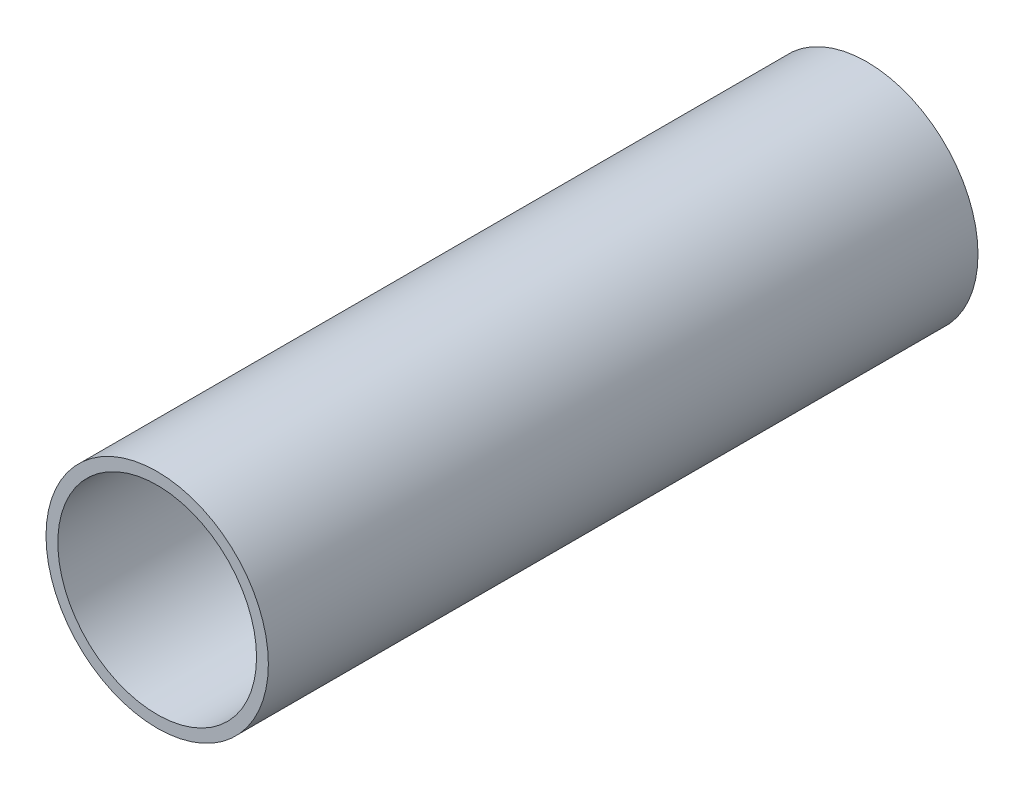
ISO-10303-21;
HEADER;
FILE_DESCRIPTION(('STEP AP214'),'2;1');
FILE_NAME('part.step','',(''),(''),'','','');
FILE_SCHEMA(('AUTOMOTIVE_DESIGN { 1 0 10303 214 1 1 1 1 }'));
ENDSEC;
DATA;
#1=APPLICATION_CONTEXT('core data for automotive mechanical design processes');
#2=APPLICATION_PROTOCOL_DEFINITION('international standard','automotive_design',2000,#1);
#3=PRODUCT_CONTEXT('',#1,'mechanical');
#4=PRODUCT('Part','Part','',(#3));
#5=PRODUCT_RELATED_PRODUCT_CATEGORY('part','',(#4));
#6=PRODUCT_DEFINITION_FORMATION('','',#4);
#7=PRODUCT_DEFINITION_CONTEXT('part definition',#1,'design');
#8=PRODUCT_DEFINITION('design','',#6,#7);
#9=PRODUCT_DEFINITION_SHAPE('','',#8);
#10=(LENGTH_UNIT() NAMED_UNIT(*) SI_UNIT(.MILLI.,.METRE.));
#11=(NAMED_UNIT(*) PLANE_ANGLE_UNIT() SI_UNIT($,.RADIAN.));
#12=(NAMED_UNIT(*) SI_UNIT($,.STERADIAN.) SOLID_ANGLE_UNIT());
#13=UNCERTAINTY_MEASURE_WITH_UNIT(LENGTH_MEASURE(1.E-05),#10,'distance_accuracy_value','');
#14=(GEOMETRIC_REPRESENTATION_CONTEXT(3) GLOBAL_UNCERTAINTY_ASSIGNED_CONTEXT((#13)) GLOBAL_UNIT_ASSIGNED_CONTEXT((#10,
#11,#12)) REPRESENTATION_CONTEXT('',''));
#15=CARTESIAN_POINT('',(0.,0.,0.));
#16=DIRECTION('',(0.,0.,1.));
#17=DIRECTION('',(1.,0.,0.));
#18=AXIS2_PLACEMENT_3D('',#15,#16,#17);
#19=CARTESIAN_POINT('',(0.,0.,38.1));
#20=DIRECTION('',(0.,0.,-1.));
#21=DIRECTION('',(-1.,0.,0.));
#22=AXIS2_PLACEMENT_3D('',#19,#20,#21);
#23=CYLINDRICAL_SURFACE('',#22,5.969);
#24=CARTESIAN_POINT('',(0.,0.,38.1));
#25=DIRECTION('',(0.,0.,1.));
#26=DIRECTION('',(1.,0.,0.));
#27=AXIS2_PLACEMENT_3D('',#24,#25,#26);
#28=CIRCLE('',#27,5.969);
#29=CARTESIAN_POINT('',(5.969,0.,38.1));
#30=VERTEX_POINT('',#29);
#31=EDGE_CURVE('E10',#30,#30,#28,.T.);
#32=ORIENTED_EDGE('',*,*,#31,.F.);
#33=EDGE_LOOP('',(#32));
#34=FACE_BOUND('',#33,.T.);
#35=CARTESIAN_POINT('',(0.,0.,0.));
#36=DIRECTION('',(0.,0.,1.));
#37=DIRECTION('',(1.,0.,0.));
#38=AXIS2_PLACEMENT_3D('',#35,#36,#37);
#39=CIRCLE('',#38,5.969);
#40=CARTESIAN_POINT('',(5.969,0.,0.));
#41=VERTEX_POINT('',#40);
#42=EDGE_CURVE('E38',#41,#41,#39,.T.);
#43=ORIENTED_EDGE('',*,*,#42,.T.);
#44=EDGE_LOOP('',(#43));
#45=FACE_BOUND('',#44,.T.);
#46=ADVANCED_FACE('F35',(#34,#45),#23,.T.);
#47=CARTESIAN_POINT('',(0.,0.,38.1));
#48=DIRECTION('',(0.,0.,1.));
#49=DIRECTION('',(1.,0.,0.));
#50=AXIS2_PLACEMENT_3D('',#47,#48,#49);
#51=PLANE('',#50);
#52=CARTESIAN_POINT('',(0.,0.,38.1));
#53=DIRECTION('',(0.,0.,1.));
#54=DIRECTION('',(1.,0.,0.));
#55=AXIS2_PLACEMENT_3D('',#52,#53,#54);
#56=CIRCLE('',#55,5.334);
#57=CARTESIAN_POINT('',(5.334,0.,38.1));
#58=VERTEX_POINT('',#57);
#59=EDGE_CURVE('E47',#58,#58,#56,.T.);
#60=ORIENTED_EDGE('',*,*,#59,.F.);
#61=EDGE_LOOP('',(#60));
#62=FACE_BOUND('',#61,.T.);
#63=ORIENTED_EDGE('',*,*,#31,.T.);
#64=EDGE_LOOP('',(#63));
#65=FACE_BOUND('',#64,.T.);
#66=ADVANCED_FACE('F62',(#62,#65),#51,.T.);
#67=CARTESIAN_POINT('',(0.,0.,0.));
#68=DIRECTION('',(0.,0.,1.));
#69=DIRECTION('',(1.,0.,0.));
#70=AXIS2_PLACEMENT_3D('',#67,#68,#69);
#71=PLANE('',#70);
#72=CARTESIAN_POINT('',(0.,0.,0.));
#73=DIRECTION('',(0.,0.,1.));
#74=DIRECTION('',(1.,0.,0.));
#75=AXIS2_PLACEMENT_3D('',#72,#73,#74);
#76=CIRCLE('',#75,5.334);
#77=CARTESIAN_POINT('',(5.334,0.,0.));
#78=VERTEX_POINT('',#77);
#79=EDGE_CURVE('E45',#78,#78,#76,.T.);
#80=ORIENTED_EDGE('',*,*,#79,.T.);
#81=EDGE_LOOP('',(#80));
#82=FACE_BOUND('',#81,.T.);
#83=ORIENTED_EDGE('',*,*,#42,.F.);
#84=EDGE_LOOP('',(#83));
#85=FACE_BOUND('',#84,.T.);
#86=ADVANCED_FACE('F53',(#82,#85),#71,.F.);
#87=CARTESIAN_POINT('',(0.,0.,0.));
#88=DIRECTION('',(0.,0.,1.));
#89=DIRECTION('',(1.,0.,0.));
#90=AXIS2_PLACEMENT_3D('',#87,#88,#89);
#91=CYLINDRICAL_SURFACE('',#90,5.334);
#92=ORIENTED_EDGE('',*,*,#79,.F.);
#93=EDGE_LOOP('',(#92));
#94=FACE_BOUND('',#93,.T.);
#95=ORIENTED_EDGE('',*,*,#59,.T.);
#96=EDGE_LOOP('',(#95));
#97=FACE_BOUND('',#96,.T.);
#98=ADVANCED_FACE('F56',(#94,#97),#91,.F.);
#99=CLOSED_SHELL('',(#46,#66,#86,#98));
#100=MANIFOLD_SOLID_BREP('B2',#99);
#101=ADVANCED_BREP_SHAPE_REPRESENTATION('',(#18,#100),#14);
#102=SHAPE_DEFINITION_REPRESENTATION(#9,#101);
ENDSEC;
END-ISO-10303-21;
